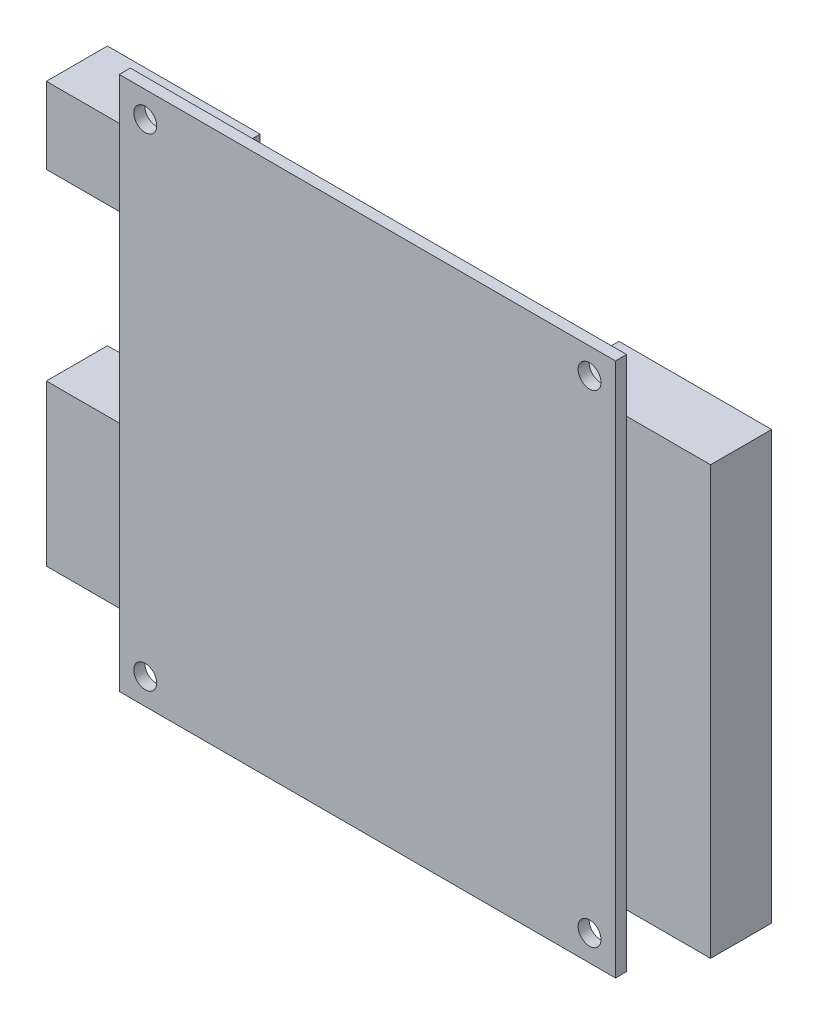
ISO-10303-21;
HEADER;
FILE_DESCRIPTION(('STEP AP214'),'2;1');
FILE_NAME('part.step','',(''),(''),'','','');
FILE_SCHEMA(('AUTOMOTIVE_DESIGN { 1 0 10303 214 1 1 1 1 }'));
ENDSEC;
DATA;
#1=APPLICATION_CONTEXT('core data for automotive mechanical design processes');
#2=APPLICATION_PROTOCOL_DEFINITION('international standard','automotive_design',2000,#1);
#3=PRODUCT_CONTEXT('',#1,'mechanical');
#4=PRODUCT('Part','Part','',(#3));
#5=PRODUCT_RELATED_PRODUCT_CATEGORY('part','',(#4));
#6=PRODUCT_DEFINITION_FORMATION('','',#4);
#7=PRODUCT_DEFINITION_CONTEXT('part definition',#1,'design');
#8=PRODUCT_DEFINITION('design','',#6,#7);
#9=PRODUCT_DEFINITION_SHAPE('','',#8);
#10=(LENGTH_UNIT() NAMED_UNIT(*) SI_UNIT(.MILLI.,.METRE.));
#11=(NAMED_UNIT(*) PLANE_ANGLE_UNIT() SI_UNIT($,.RADIAN.));
#12=(NAMED_UNIT(*) SI_UNIT($,.STERADIAN.) SOLID_ANGLE_UNIT());
#13=UNCERTAINTY_MEASURE_WITH_UNIT(LENGTH_MEASURE(1.E-05),#10,'distance_accuracy_value','');
#14=(GEOMETRIC_REPRESENTATION_CONTEXT(3) GLOBAL_UNCERTAINTY_ASSIGNED_CONTEXT((#13)) GLOBAL_UNIT_ASSIGNED_CONTEXT((#10,
#11,#12)) REPRESENTATION_CONTEXT('',''));
#15=CARTESIAN_POINT('',(0.,0.,0.));
#16=DIRECTION('',(0.,0.,1.));
#17=DIRECTION('',(1.,0.,0.));
#18=AXIS2_PLACEMENT_3D('',#15,#16,#17);
#19=CARTESIAN_POINT('',(0.,0.,0.));
#20=DIRECTION('',(0.,0.,1.));
#21=DIRECTION('',(1.,0.,0.));
#22=AXIS2_PLACEMENT_3D('',#19,#20,#21);
#23=PLANE('',#22);
#24=CARTESIAN_POINT('',(-29.1000000000001,-31.6000000000001,0.));
#25=DIRECTION('',(0.,0.,1.));
#26=DIRECTION('',(-1.,0.,0.));
#27=AXIS2_PLACEMENT_3D('',#24,#25,#26);
#28=CIRCLE('',#27,1.5);
#29=CARTESIAN_POINT('',(-30.6000000000001,-31.6000000000001,0.));
#30=VERTEX_POINT('',#29);
#31=EDGE_CURVE('E339',#30,#30,#28,.T.);
#32=ORIENTED_EDGE('',*,*,#31,.T.);
#33=EDGE_LOOP('',(#32));
#34=FACE_BOUND('',#33,.T.);
#35=CARTESIAN_POINT('',(29.1000000000001,-31.6000000000001,0.));
#36=DIRECTION('',(0.,0.,-1.));
#37=DIRECTION('',(1.,0.,0.));
#38=AXIS2_PLACEMENT_3D('',#35,#36,#37);
#39=CIRCLE('',#38,1.5);
#40=CARTESIAN_POINT('',(30.6000000000001,-31.6000000000001,0.));
#41=VERTEX_POINT('',#40);
#42=EDGE_CURVE('E343',#41,#41,#39,.T.);
#43=ORIENTED_EDGE('',*,*,#42,.F.);
#44=EDGE_LOOP('',(#43));
#45=FACE_BOUND('',#44,.T.);
#46=CARTESIAN_POINT('',(29.1000000000001,31.6000000000001,0.));
#47=DIRECTION('',(0.,0.,1.));
#48=DIRECTION('',(1.,0.,0.));
#49=AXIS2_PLACEMENT_3D('',#46,#47,#48);
#50=CIRCLE('',#49,1.5);
#51=CARTESIAN_POINT('',(30.6000000000001,31.6000000000001,0.));
#52=VERTEX_POINT('',#51);
#53=EDGE_CURVE('E349',#52,#52,#50,.T.);
#54=ORIENTED_EDGE('',*,*,#53,.T.);
#55=EDGE_LOOP('',(#54));
#56=FACE_BOUND('',#55,.T.);
#57=CARTESIAN_POINT('',(-29.1000000000001,31.6000000000001,0.));
#58=DIRECTION('',(0.,0.,-1.));
#59=DIRECTION('',(-1.,0.,0.));
#60=AXIS2_PLACEMENT_3D('',#57,#58,#59);
#61=CIRCLE('',#60,1.5);
#62=CARTESIAN_POINT('',(-30.6000000000001,31.6000000000001,0.));
#63=VERTEX_POINT('',#62);
#64=EDGE_CURVE('E355',#63,#63,#61,.T.);
#65=ORIENTED_EDGE('',*,*,#64,.F.);
#66=EDGE_LOOP('',(#65));
#67=FACE_BOUND('',#66,.T.);
#68=DIRECTION('',(-1.,0.,0.));
#69=VECTOR('',#68,1.);
#70=CARTESIAN_POINT('',(-23.5000000000001,-26.9999999999999,0.));
#71=LINE('',#70,#69);
#72=CARTESIAN_POINT('',(-23.5000000000001,-26.9999999999999,0.));
#73=VERTEX_POINT('',#72);
#74=CARTESIAN_POINT('',(-32.5000000000001,-26.9999999999999,0.));
#75=VERTEX_POINT('',#74);
#76=EDGE_CURVE('E51',#73,#75,#71,.T.);
#77=ORIENTED_EDGE('',*,*,#76,.F.);
#78=DIRECTION('',(0.,-1.,0.));
#79=VECTOR('',#78,1.);
#80=CARTESIAN_POINT('',(-23.5000000000001,-5.99999999999991,0.));
#81=LINE('',#80,#79);
#82=CARTESIAN_POINT('',(-23.5000000000001,-5.99999999999991,0.));
#83=VERTEX_POINT('',#82);
#84=EDGE_CURVE('E252',#83,#73,#81,.T.);
#85=ORIENTED_EDGE('',*,*,#84,.F.);
#86=DIRECTION('',(1.,0.,0.));
#87=VECTOR('',#86,1.);
#88=CARTESIAN_POINT('',(-23.5000000000001,-5.99999999999991,0.));
#89=LINE('',#88,#87);
#90=CARTESIAN_POINT('',(-32.5000000000001,-5.99999999999991,0.));
#91=VERTEX_POINT('',#90);
#92=EDGE_CURVE('E266',#91,#83,#89,.T.);
#93=ORIENTED_EDGE('',*,*,#92,.F.);
#94=DIRECTION('',(0.,-1.,0.));
#95=VECTOR('',#94,1.);
#96=CARTESIAN_POINT('',(-32.5000000000001,35.0000000000001,0.));
#97=LINE('',#96,#95);
#98=CARTESIAN_POINT('',(-32.5000000000001,-4.99999999999991,0.));
#99=VERTEX_POINT('',#98);
#100=EDGE_CURVE('E418',#99,#91,#97,.T.);
#101=ORIENTED_EDGE('',*,*,#100,.F.);
#102=DIRECTION('',(-1.,0.,0.));
#103=VECTOR('',#102,1.);
#104=CARTESIAN_POINT('',(-23.5000000000001,-4.99999999999991,0.));
#105=LINE('',#104,#103);
#106=CARTESIAN_POINT('',(-23.5000000000001,-4.99999999999991,0.));
#107=VERTEX_POINT('',#106);
#108=EDGE_CURVE('E59',#107,#99,#105,.T.);
#109=ORIENTED_EDGE('',*,*,#108,.F.);
#110=DIRECTION('',(0.,-1.,0.));
#111=VECTOR('',#110,1.);
#112=CARTESIAN_POINT('',(-23.5000000000001,17.0000000000001,0.));
#113=LINE('',#112,#111);
#114=CARTESIAN_POINT('',(-23.5000000000001,17.0000000000001,0.));
#115=VERTEX_POINT('',#114);
#116=EDGE_CURVE('E273',#115,#107,#113,.T.);
#117=ORIENTED_EDGE('',*,*,#116,.F.);
#118=DIRECTION('',(1.,0.,0.));
#119=VECTOR('',#118,1.);
#120=CARTESIAN_POINT('',(-23.5000000000001,17.0000000000001,0.));
#121=LINE('',#120,#119);
#122=CARTESIAN_POINT('',(-32.5000000000001,17.0000000000001,0.));
#123=VERTEX_POINT('',#122);
#124=EDGE_CURVE('E291',#123,#115,#121,.T.);
#125=ORIENTED_EDGE('',*,*,#124,.F.);
#126=CARTESIAN_POINT('',(-32.5000000000001,18.0000000000001,0.));
#127=VERTEX_POINT('',#126);
#128=EDGE_CURVE('E414',#127,#123,#97,.T.);
#129=ORIENTED_EDGE('',*,*,#128,.F.);
#130=DIRECTION('',(-1.,0.,0.));
#131=VECTOR('',#130,1.);
#132=CARTESIAN_POINT('',(-23.5000000000001,18.0000000000001,0.));
#133=LINE('',#132,#131);
#134=CARTESIAN_POINT('',(-23.5000000000001,18.0000000000001,0.));
#135=VERTEX_POINT('',#134);
#136=EDGE_CURVE('E317',#135,#127,#133,.T.);
#137=ORIENTED_EDGE('',*,*,#136,.F.);
#138=DIRECTION('',(0.,-1.,0.));
#139=VECTOR('',#138,1.);
#140=CARTESIAN_POINT('',(-23.5000000000001,28.0000000000001,0.));
#141=LINE('',#140,#139);
#142=CARTESIAN_POINT('',(-23.5000000000001,28.0000000000001,0.));
#143=VERTEX_POINT('',#142);
#144=EDGE_CURVE('E304',#143,#135,#141,.T.);
#145=ORIENTED_EDGE('',*,*,#144,.F.);
#146=DIRECTION('',(1.,0.,0.));
#147=VECTOR('',#146,1.);
#148=CARTESIAN_POINT('',(-23.5000000000001,28.0000000000001,0.));
#149=LINE('',#148,#147);
#150=CARTESIAN_POINT('',(-32.5000000000001,28.0000000000001,0.));
#151=VERTEX_POINT('',#150);
#152=EDGE_CURVE('E319',#151,#143,#149,.T.);
#153=ORIENTED_EDGE('',*,*,#152,.F.);
#154=CARTESIAN_POINT('',(-32.5000000000001,35.0000000000001,0.));
#155=VERTEX_POINT('',#154);
#156=EDGE_CURVE('E382',#155,#151,#97,.T.);
#157=ORIENTED_EDGE('',*,*,#156,.F.);
#158=DIRECTION('',(-1.,0.,0.));
#159=VECTOR('',#158,1.);
#160=CARTESIAN_POINT('',(-32.5000000000001,35.0000000000001,0.));
#161=LINE('',#160,#159);
#162=CARTESIAN_POINT('',(32.4999999999999,35.0000000000001,0.));
#163=VERTEX_POINT('',#162);
#164=EDGE_CURVE('E378',#163,#155,#161,.T.);
#165=ORIENTED_EDGE('',*,*,#164,.F.);
#166=DIRECTION('',(0.,1.,0.));
#167=VECTOR('',#166,1.);
#168=CARTESIAN_POINT('',(32.4999999999999,35.0000000000001,0.));
#169=LINE('',#168,#167);
#170=CARTESIAN_POINT('',(32.4999999999999,28.0000000000001,0.));
#171=VERTEX_POINT('',#170);
#172=EDGE_CURVE('E361',#171,#163,#169,.T.);
#173=ORIENTED_EDGE('',*,*,#172,.F.);
#174=DIRECTION('',(1.,0.,0.));
#175=VECTOR('',#174,1.);
#176=CARTESIAN_POINT('',(33.4999999999999,28.0000000000001,0.));
#177=LINE('',#176,#175);
#178=CARTESIAN_POINT('',(23.4999999999999,28.0000000000001,0.));
#179=VERTEX_POINT('',#178);
#180=EDGE_CURVE('E328',#179,#171,#177,.T.);
#181=ORIENTED_EDGE('',*,*,#180,.F.);
#182=DIRECTION('',(0.,1.,0.));
#183=VECTOR('',#182,1.);
#184=CARTESIAN_POINT('',(23.4999999999999,28.0000000000001,0.));
#185=LINE('',#184,#183);
#186=CARTESIAN_POINT('',(23.4999999999999,-27.9999999999999,0.));
#187=VERTEX_POINT('',#186);
#188=EDGE_CURVE('E331',#187,#179,#185,.T.);
#189=ORIENTED_EDGE('',*,*,#188,.F.);
#190=DIRECTION('',(-1.,0.,0.));
#191=VECTOR('',#190,1.);
#192=CARTESIAN_POINT('',(33.4999999999999,-27.9999999999999,0.));
#193=LINE('',#192,#191);
#194=CARTESIAN_POINT('',(32.4999999999999,-27.9999999999999,0.));
#195=VERTEX_POINT('',#194);
#196=EDGE_CURVE('E11',#195,#187,#193,.T.);
#197=ORIENTED_EDGE('',*,*,#196,.F.);
#198=CARTESIAN_POINT('',(32.4999999999999,-34.9999999999999,0.));
#199=VERTEX_POINT('',#198);
#200=EDGE_CURVE('E375',#199,#195,#169,.T.);
#201=ORIENTED_EDGE('',*,*,#200,.F.);
#202=DIRECTION('',(1.,0.,0.));
#203=VECTOR('',#202,1.);
#204=CARTESIAN_POINT('',(-32.5000000000001,-34.9999999999999,0.));
#205=LINE('',#204,#203);
#206=CARTESIAN_POINT('',(-32.5000000000001,-34.9999999999999,0.));
#207=VERTEX_POINT('',#206);
#208=EDGE_CURVE('E368',#207,#199,#205,.T.);
#209=ORIENTED_EDGE('',*,*,#208,.F.);
#210=EDGE_CURVE('E381',#75,#207,#97,.T.);
#211=ORIENTED_EDGE('',*,*,#210,.F.);
#212=EDGE_LOOP('',(#77,#85,#93,#101,#109,#117,#125,#129,#137,#145,#153,#157,#165,#173,#181,#189,
#197,#201,#209,#211));
#213=FACE_BOUND('',#212,.T.);
#214=ADVANCED_FACE('F34',(#34,#45,#56,#67,#213),#23,.F.);
#215=CARTESIAN_POINT('',(32.4999999999999,35.0000000000001,1.45));
#216=DIRECTION('',(-1.,0.,0.));
#217=DIRECTION('',(0.,0.,1.));
#218=AXIS2_PLACEMENT_3D('',#215,#216,#217);
#219=PLANE('',#218);
#220=ORIENTED_EDGE('',*,*,#200,.T.);
#221=EDGE_CURVE('E379',#195,#171,#169,.T.);
#222=ORIENTED_EDGE('',*,*,#221,.T.);
#223=ORIENTED_EDGE('',*,*,#172,.T.);
#224=DIRECTION('',(0.,0.,-1.));
#225=VECTOR('',#224,1.);
#226=CARTESIAN_POINT('',(32.4999999999999,35.0000000000001,1.45));
#227=LINE('',#226,#225);
#228=CARTESIAN_POINT('',(32.4999999999999,35.0000000000001,1.45));
#229=VERTEX_POINT('',#228);
#230=EDGE_CURVE('E38',#229,#163,#227,.T.);
#231=ORIENTED_EDGE('',*,*,#230,.F.);
#232=DIRECTION('',(0.,1.,0.));
#233=VECTOR('',#232,1.);
#234=CARTESIAN_POINT('',(32.4999999999999,35.0000000000001,1.45));
#235=LINE('',#234,#233);
#236=CARTESIAN_POINT('',(32.4999999999999,-34.9999999999999,1.45));
#237=VERTEX_POINT('',#236);
#238=EDGE_CURVE('E364',#237,#229,#235,.T.);
#239=ORIENTED_EDGE('',*,*,#238,.F.);
#240=DIRECTION('',(0.,0.,-1.));
#241=VECTOR('',#240,1.);
#242=CARTESIAN_POINT('',(32.4999999999999,-34.9999999999999,1.45));
#243=LINE('',#242,#241);
#244=EDGE_CURVE('E374',#237,#199,#243,.T.);
#245=ORIENTED_EDGE('',*,*,#244,.T.);
#246=EDGE_LOOP('',(#220,#222,#223,#231,#239,#245));
#247=FACE_BOUND('',#246,.T.);
#248=ADVANCED_FACE('F36',(#247),#219,.F.);
#249=CARTESIAN_POINT('',(-32.5000000000001,35.0000000000001,1.45));
#250=DIRECTION('',(0.,-1.,0.));
#251=DIRECTION('',(0.,0.,-1.));
#252=AXIS2_PLACEMENT_3D('',#249,#250,#251);
#253=PLANE('',#252);
#254=ORIENTED_EDGE('',*,*,#164,.T.);
#255=DIRECTION('',(0.,0.,-1.));
#256=VECTOR('',#255,1.);
#257=CARTESIAN_POINT('',(-32.5000000000001,35.0000000000001,1.45));
#258=LINE('',#257,#256);
#259=CARTESIAN_POINT('',(-32.5000000000001,35.0000000000001,1.45));
#260=VERTEX_POINT('',#259);
#261=EDGE_CURVE('E391',#260,#155,#258,.T.);
#262=ORIENTED_EDGE('',*,*,#261,.F.);
#263=DIRECTION('',(-1.,0.,0.));
#264=VECTOR('',#263,1.);
#265=CARTESIAN_POINT('',(-32.5000000000001,35.0000000000001,1.45));
#266=LINE('',#265,#264);
#267=EDGE_CURVE('E367',#229,#260,#266,.T.);
#268=ORIENTED_EDGE('',*,*,#267,.F.);
#269=ORIENTED_EDGE('',*,*,#230,.T.);
#270=EDGE_LOOP('',(#254,#262,#268,#269));
#271=FACE_BOUND('',#270,.T.);
#272=ADVANCED_FACE('F400',(#271),#253,.F.);
#273=CARTESIAN_POINT('',(-32.5000000000001,35.0000000000001,1.45));
#274=DIRECTION('',(1.,0.,0.));
#275=DIRECTION('',(0.,1.,0.));
#276=AXIS2_PLACEMENT_3D('',#273,#274,#275);
#277=PLANE('',#276);
#278=ORIENTED_EDGE('',*,*,#156,.T.);
#279=EDGE_CURVE('E385',#151,#127,#97,.T.);
#280=ORIENTED_EDGE('',*,*,#279,.T.);
#281=ORIENTED_EDGE('',*,*,#128,.T.);
#282=EDGE_CURVE('E417',#123,#99,#97,.T.);
#283=ORIENTED_EDGE('',*,*,#282,.T.);
#284=ORIENTED_EDGE('',*,*,#100,.T.);
#285=EDGE_CURVE('E420',#91,#75,#97,.T.);
#286=ORIENTED_EDGE('',*,*,#285,.T.);
#287=ORIENTED_EDGE('',*,*,#210,.T.);
#288=DIRECTION('',(0.,0.,-1.));
#289=VECTOR('',#288,1.);
#290=CARTESIAN_POINT('',(-32.5000000000001,-34.9999999999999,1.45));
#291=LINE('',#290,#289);
#292=CARTESIAN_POINT('',(-32.5000000000001,-34.9999999999999,1.45));
#293=VERTEX_POINT('',#292);
#294=EDGE_CURVE('E389',#293,#207,#291,.T.);
#295=ORIENTED_EDGE('',*,*,#294,.F.);
#296=DIRECTION('',(0.,-1.,0.));
#297=VECTOR('',#296,1.);
#298=CARTESIAN_POINT('',(-32.5000000000001,35.0000000000001,1.45));
#299=LINE('',#298,#297);
#300=EDGE_CURVE('E370',#260,#293,#299,.T.);
#301=ORIENTED_EDGE('',*,*,#300,.F.);
#302=ORIENTED_EDGE('',*,*,#261,.T.);
#303=EDGE_LOOP('',(#278,#280,#281,#283,#284,#286,#287,#295,#301,#302));
#304=FACE_BOUND('',#303,.T.);
#305=ADVANCED_FACE('F410',(#304),#277,.F.);
#306=CARTESIAN_POINT('',(-32.5000000000001,-34.9999999999999,1.45));
#307=DIRECTION('',(0.,1.,0.));
#308=DIRECTION('',(0.,0.,1.));
#309=AXIS2_PLACEMENT_3D('',#306,#307,#308);
#310=PLANE('',#309);
#311=ORIENTED_EDGE('',*,*,#208,.T.);
#312=ORIENTED_EDGE('',*,*,#244,.F.);
#313=DIRECTION('',(1.,0.,0.));
#314=VECTOR('',#313,1.);
#315=CARTESIAN_POINT('',(-32.5000000000001,-34.9999999999999,1.45));
#316=LINE('',#315,#314);
#317=EDGE_CURVE('E372',#293,#237,#316,.T.);
#318=ORIENTED_EDGE('',*,*,#317,.F.);
#319=ORIENTED_EDGE('',*,*,#294,.T.);
#320=EDGE_LOOP('',(#311,#312,#318,#319));
#321=FACE_BOUND('',#320,.T.);
#322=ADVANCED_FACE('F428',(#321),#310,.F.);
#323=CARTESIAN_POINT('',(0.,0.,1.45));
#324=DIRECTION('',(0.,0.,1.));
#325=DIRECTION('',(1.,0.,0.));
#326=AXIS2_PLACEMENT_3D('',#323,#324,#325);
#327=PLANE('',#326);
#328=CARTESIAN_POINT('',(-29.1000000000001,-31.6000000000001,1.45));
#329=DIRECTION('',(0.,0.,1.));
#330=DIRECTION('',(-1.,0.,0.));
#331=AXIS2_PLACEMENT_3D('',#328,#329,#330);
#332=CIRCLE('',#331,1.5);
#333=CARTESIAN_POINT('',(-30.6000000000001,-31.6000000000001,1.45));
#334=VERTEX_POINT('',#333);
#335=EDGE_CURVE('E340',#334,#334,#332,.T.);
#336=ORIENTED_EDGE('',*,*,#335,.F.);
#337=EDGE_LOOP('',(#336));
#338=FACE_BOUND('',#337,.T.);
#339=CARTESIAN_POINT('',(29.1000000000001,-31.6000000000001,1.45));
#340=DIRECTION('',(0.,0.,-1.));
#341=DIRECTION('',(1.,0.,0.));
#342=AXIS2_PLACEMENT_3D('',#339,#340,#341);
#343=CIRCLE('',#342,1.5);
#344=CARTESIAN_POINT('',(30.6000000000001,-31.6000000000001,1.45));
#345=VERTEX_POINT('',#344);
#346=EDGE_CURVE('E346',#345,#345,#343,.T.);
#347=ORIENTED_EDGE('',*,*,#346,.T.);
#348=EDGE_LOOP('',(#347));
#349=FACE_BOUND('',#348,.T.);
#350=CARTESIAN_POINT('',(29.1000000000001,31.6000000000001,1.45));
#351=DIRECTION('',(0.,0.,1.));
#352=DIRECTION('',(1.,0.,0.));
#353=AXIS2_PLACEMENT_3D('',#350,#351,#352);
#354=CIRCLE('',#353,1.5);
#355=CARTESIAN_POINT('',(30.6000000000001,31.6000000000001,1.45));
#356=VERTEX_POINT('',#355);
#357=EDGE_CURVE('E352',#356,#356,#354,.T.);
#358=ORIENTED_EDGE('',*,*,#357,.F.);
#359=EDGE_LOOP('',(#358));
#360=FACE_BOUND('',#359,.T.);
#361=CARTESIAN_POINT('',(-29.1000000000001,31.6000000000001,1.45));
#362=DIRECTION('',(0.,0.,-1.));
#363=DIRECTION('',(-1.,0.,0.));
#364=AXIS2_PLACEMENT_3D('',#361,#362,#363);
#365=CIRCLE('',#364,1.5);
#366=CARTESIAN_POINT('',(-30.6000000000001,31.6000000000001,1.45));
#367=VERTEX_POINT('',#366);
#368=EDGE_CURVE('E358',#367,#367,#365,.T.);
#369=ORIENTED_EDGE('',*,*,#368,.T.);
#370=EDGE_LOOP('',(#369));
#371=FACE_BOUND('',#370,.T.);
#372=ORIENTED_EDGE('',*,*,#238,.T.);
#373=ORIENTED_EDGE('',*,*,#267,.T.);
#374=ORIENTED_EDGE('',*,*,#300,.T.);
#375=ORIENTED_EDGE('',*,*,#317,.T.);
#376=EDGE_LOOP('',(#372,#373,#374,#375));
#377=FACE_BOUND('',#376,.T.);
#378=ADVANCED_FACE('F456',(#338,#349,#360,#371,#377),#327,.T.);
#379=CARTESIAN_POINT('',(-29.1000000000001,31.6000000000001,1.45));
#380=DIRECTION('',(0.,0.,-1.));
#381=DIRECTION('',(-1.,0.,0.));
#382=AXIS2_PLACEMENT_3D('',#379,#380,#381);
#383=CYLINDRICAL_SURFACE('',#382,1.5);
#384=ORIENTED_EDGE('',*,*,#368,.F.);
#385=EDGE_LOOP('',(#384));
#386=FACE_BOUND('',#385,.T.);
#387=ORIENTED_EDGE('',*,*,#64,.T.);
#388=EDGE_LOOP('',(#387));
#389=FACE_BOUND('',#388,.T.);
#390=ADVANCED_FACE('F482',(#386,#389),#383,.F.);
#391=CARTESIAN_POINT('',(29.1000000000001,31.6000000000001,1.45));
#392=DIRECTION('',(0.,0.,-1.));
#393=DIRECTION('',(-1.,0.,0.));
#394=AXIS2_PLACEMENT_3D('',#391,#392,#393);
#395=CYLINDRICAL_SURFACE('',#394,1.5);
#396=ORIENTED_EDGE('',*,*,#357,.T.);
#397=EDGE_LOOP('',(#396));
#398=FACE_BOUND('',#397,.T.);
#399=ORIENTED_EDGE('',*,*,#53,.F.);
#400=EDGE_LOOP('',(#399));
#401=FACE_BOUND('',#400,.T.);
#402=ADVANCED_FACE('F490',(#398,#401),#395,.F.);
#403=CARTESIAN_POINT('',(29.1000000000001,-31.6000000000001,1.45));
#404=DIRECTION('',(0.,0.,-1.));
#405=DIRECTION('',(-1.,0.,0.));
#406=AXIS2_PLACEMENT_3D('',#403,#404,#405);
#407=CYLINDRICAL_SURFACE('',#406,1.5);
#408=ORIENTED_EDGE('',*,*,#346,.F.);
#409=EDGE_LOOP('',(#408));
#410=FACE_BOUND('',#409,.T.);
#411=ORIENTED_EDGE('',*,*,#42,.T.);
#412=EDGE_LOOP('',(#411));
#413=FACE_BOUND('',#412,.T.);
#414=ADVANCED_FACE('F496',(#410,#413),#407,.F.);
#415=CARTESIAN_POINT('',(-29.1000000000001,-31.6000000000001,1.45));
#416=DIRECTION('',(0.,0.,-1.));
#417=DIRECTION('',(-1.,0.,0.));
#418=AXIS2_PLACEMENT_3D('',#415,#416,#417);
#419=CYLINDRICAL_SURFACE('',#418,1.5);
#420=ORIENTED_EDGE('',*,*,#335,.T.);
#421=EDGE_LOOP('',(#420));
#422=FACE_BOUND('',#421,.T.);
#423=ORIENTED_EDGE('',*,*,#31,.F.);
#424=EDGE_LOOP('',(#423));
#425=FACE_BOUND('',#424,.T.);
#426=ADVANCED_FACE('F445',(#422,#425),#419,.F.);
#427=CARTESIAN_POINT('',(33.4999999999999,-27.9999999999999,-8.));
#428=DIRECTION('',(0.,1.,0.));
#429=DIRECTION('',(0.,0.,1.));
#430=AXIS2_PLACEMENT_3D('',#427,#428,#429);
#431=PLANE('',#430);
#432=CARTESIAN_POINT('',(43.4999999999999,-27.9999999999999,0.));
#433=VERTEX_POINT('',#432);
#434=EDGE_CURVE('E44',#433,#195,#193,.T.);
#435=ORIENTED_EDGE('',*,*,#434,.T.);
#436=ORIENTED_EDGE('',*,*,#196,.T.);
#437=DIRECTION('',(0.,0.,1.));
#438=VECTOR('',#437,1.);
#439=CARTESIAN_POINT('',(23.4999999999999,-27.9999999999999,-8.));
#440=LINE('',#439,#438);
#441=CARTESIAN_POINT('',(23.4999999999999,-27.9999999999999,-8.));
#442=VERTEX_POINT('',#441);
#443=EDGE_CURVE('E336',#442,#187,#440,.T.);
#444=ORIENTED_EDGE('',*,*,#443,.F.);
#445=DIRECTION('',(-1.,0.,0.));
#446=VECTOR('',#445,1.);
#447=CARTESIAN_POINT('',(33.4999999999999,-27.9999999999999,-8.));
#448=LINE('',#447,#446);
#449=CARTESIAN_POINT('',(43.4999999999999,-27.9999999999999,-8.));
#450=VERTEX_POINT('',#449);
#451=EDGE_CURVE('E326',#450,#442,#448,.T.);
#452=ORIENTED_EDGE('',*,*,#451,.F.);
#453=DIRECTION('',(0.,0.,-1.));
#454=VECTOR('',#453,1.);
#455=CARTESIAN_POINT('',(43.4999999999999,-27.9999999999999,-8.));
#456=LINE('',#455,#454);
#457=EDGE_CURVE('E223',#433,#450,#456,.T.);
#458=ORIENTED_EDGE('',*,*,#457,.F.);
#459=EDGE_LOOP('',(#435,#436,#444,#452,#458));
#460=FACE_BOUND('',#459,.T.);
#461=ADVANCED_FACE('F434',(#460),#431,.F.);
#462=CARTESIAN_POINT('',(23.4999999999999,28.0000000000001,-8.));
#463=DIRECTION('',(1.,0.,0.));
#464=DIRECTION('',(0.,1.,0.));
#465=AXIS2_PLACEMENT_3D('',#462,#463,#464);
#466=PLANE('',#465);
#467=ORIENTED_EDGE('',*,*,#188,.T.);
#468=DIRECTION('',(0.,0.,1.));
#469=VECTOR('',#468,1.);
#470=CARTESIAN_POINT('',(23.4999999999999,28.0000000000001,-8.));
#471=LINE('',#470,#469);
#472=CARTESIAN_POINT('',(23.4999999999999,28.0000000000001,-8.));
#473=VERTEX_POINT('',#472);
#474=EDGE_CURVE('E207',#473,#179,#471,.T.);
#475=ORIENTED_EDGE('',*,*,#474,.F.);
#476=DIRECTION('',(0.,1.,0.));
#477=VECTOR('',#476,1.);
#478=CARTESIAN_POINT('',(23.4999999999999,28.0000000000001,-8.));
#479=LINE('',#478,#477);
#480=EDGE_CURVE('E203',#442,#473,#479,.T.);
#481=ORIENTED_EDGE('',*,*,#480,.F.);
#482=ORIENTED_EDGE('',*,*,#443,.T.);
#483=EDGE_LOOP('',(#467,#475,#481,#482));
#484=FACE_BOUND('',#483,.T.);
#485=ADVANCED_FACE('F437',(#484),#466,.F.);
#486=CARTESIAN_POINT('',(33.4999999999999,28.0000000000001,-8.));
#487=DIRECTION('',(0.,-1.,0.));
#488=DIRECTION('',(0.,0.,-1.));
#489=AXIS2_PLACEMENT_3D('',#486,#487,#488);
#490=PLANE('',#489);
#491=ORIENTED_EDGE('',*,*,#180,.T.);
#492=CARTESIAN_POINT('',(43.4999999999999,28.0000000000001,0.));
#493=VERTEX_POINT('',#492);
#494=EDGE_CURVE('E214',#171,#493,#177,.T.);
#495=ORIENTED_EDGE('',*,*,#494,.T.);
#496=DIRECTION('',(0.,0.,1.));
#497=VECTOR('',#496,1.);
#498=CARTESIAN_POINT('',(43.4999999999999,28.0000000000001,-8.));
#499=LINE('',#498,#497);
#500=CARTESIAN_POINT('',(43.4999999999999,28.0000000000001,-8.));
#501=VERTEX_POINT('',#500);
#502=EDGE_CURVE('E210',#501,#493,#499,.T.);
#503=ORIENTED_EDGE('',*,*,#502,.F.);
#504=DIRECTION('',(1.,0.,0.));
#505=VECTOR('',#504,1.);
#506=CARTESIAN_POINT('',(33.4999999999999,28.0000000000001,-8.));
#507=LINE('',#506,#505);
#508=EDGE_CURVE('E197',#473,#501,#507,.T.);
#509=ORIENTED_EDGE('',*,*,#508,.F.);
#510=ORIENTED_EDGE('',*,*,#474,.T.);
#511=EDGE_LOOP('',(#491,#495,#503,#509,#510));
#512=FACE_BOUND('',#511,.T.);
#513=ADVANCED_FACE('F212',(#512),#490,.F.);
#514=CARTESIAN_POINT('',(0.,0.,-8.));
#515=DIRECTION('',(0.,0.,-1.));
#516=DIRECTION('',(-1.,0.,0.));
#517=AXIS2_PLACEMENT_3D('',#514,#515,#516);
#518=PLANE('',#517);
#519=ORIENTED_EDGE('',*,*,#508,.T.);
#520=DIRECTION('',(0.,1.,0.));
#521=VECTOR('',#520,1.);
#522=CARTESIAN_POINT('',(43.4999999999999,28.0000000000001,-8.));
#523=LINE('',#522,#521);
#524=EDGE_CURVE('E201',#450,#501,#523,.T.);
#525=ORIENTED_EDGE('',*,*,#524,.F.);
#526=ORIENTED_EDGE('',*,*,#451,.T.);
#527=ORIENTED_EDGE('',*,*,#480,.T.);
#528=EDGE_LOOP('',(#519,#525,#526,#527));
#529=FACE_BOUND('',#528,.T.);
#530=ADVANCED_FACE('F199',(#529),#518,.T.);
#531=CARTESIAN_POINT('',(0.,0.,0.));
#532=DIRECTION('',(0.,0.,-1.));
#533=DIRECTION('',(-1.,0.,0.));
#534=AXIS2_PLACEMENT_3D('',#531,#532,#533);
#535=PLANE('',#534);
#536=ORIENTED_EDGE('',*,*,#221,.F.);
#537=ORIENTED_EDGE('',*,*,#434,.F.);
#538=DIRECTION('',(0.,-1.,0.));
#539=VECTOR('',#538,1.);
#540=CARTESIAN_POINT('',(43.4999999999999,28.0000000000001,0.));
#541=LINE('',#540,#539);
#542=EDGE_CURVE('E218',#493,#433,#541,.T.);
#543=ORIENTED_EDGE('',*,*,#542,.F.);
#544=ORIENTED_EDGE('',*,*,#494,.F.);
#545=EDGE_LOOP('',(#536,#537,#543,#544));
#546=FACE_BOUND('',#545,.T.);
#547=ADVANCED_FACE('F432',(#546),#535,.F.);
#548=CARTESIAN_POINT('',(0.,0.,0.));
#549=DIRECTION('',(0.,0.,-1.));
#550=DIRECTION('',(-1.,0.,0.));
#551=AXIS2_PLACEMENT_3D('',#548,#549,#550);
#552=PLANE('',#551);
#553=CARTESIAN_POINT('',(-43.5000000000001,18.0000000000001,0.));
#554=VERTEX_POINT('',#553);
#555=EDGE_CURVE('E316',#127,#554,#133,.T.);
#556=ORIENTED_EDGE('',*,*,#555,.F.);
#557=ORIENTED_EDGE('',*,*,#279,.F.);
#558=CARTESIAN_POINT('',(-43.5000000000001,28.0000000000001,0.));
#559=VERTEX_POINT('',#558);
#560=EDGE_CURVE('E309',#559,#151,#149,.T.);
#561=ORIENTED_EDGE('',*,*,#560,.F.);
#562=DIRECTION('',(0.,1.,0.));
#563=VECTOR('',#562,1.);
#564=CARTESIAN_POINT('',(-43.5000000000001,18.0000000000001,0.));
#565=LINE('',#564,#563);
#566=EDGE_CURVE('E234',#554,#559,#565,.T.);
#567=ORIENTED_EDGE('',*,*,#566,.F.);
#568=EDGE_LOOP('',(#556,#557,#561,#567));
#569=FACE_BOUND('',#568,.T.);
#570=ADVANCED_FACE('F547',(#569),#552,.F.);
#571=CARTESIAN_POINT('',(-23.5000000000001,28.0000000000001,-8.));
#572=DIRECTION('',(-1.,0.,0.));
#573=DIRECTION('',(0.,0.,1.));
#574=AXIS2_PLACEMENT_3D('',#571,#572,#573);
#575=PLANE('',#574);
#576=ORIENTED_EDGE('',*,*,#144,.T.);
#577=DIRECTION('',(0.,0.,1.));
#578=VECTOR('',#577,1.);
#579=CARTESIAN_POINT('',(-23.5000000000001,18.0000000000001,-8.));
#580=LINE('',#579,#578);
#581=CARTESIAN_POINT('',(-23.5000000000001,18.0000000000001,-8.));
#582=VERTEX_POINT('',#581);
#583=EDGE_CURVE('E324',#582,#135,#580,.T.);
#584=ORIENTED_EDGE('',*,*,#583,.F.);
#585=DIRECTION('',(0.,-1.,0.));
#586=VECTOR('',#585,1.);
#587=CARTESIAN_POINT('',(-23.5000000000001,28.0000000000001,-8.));
#588=LINE('',#587,#586);
#589=CARTESIAN_POINT('',(-23.5000000000001,28.0000000000001,-8.));
#590=VERTEX_POINT('',#589);
#591=EDGE_CURVE('E305',#590,#582,#588,.T.);
#592=ORIENTED_EDGE('',*,*,#591,.F.);
#593=DIRECTION('',(0.,0.,1.));
#594=VECTOR('',#593,1.);
#595=CARTESIAN_POINT('',(-23.5000000000001,28.0000000000001,-8.));
#596=LINE('',#595,#594);
#597=EDGE_CURVE('E313',#590,#143,#596,.T.);
#598=ORIENTED_EDGE('',*,*,#597,.T.);
#599=EDGE_LOOP('',(#576,#584,#592,#598));
#600=FACE_BOUND('',#599,.T.);
#601=ADVANCED_FACE('F685',(#600),#575,.F.);
#602=CARTESIAN_POINT('',(-23.5000000000001,18.0000000000001,-8.));
#603=DIRECTION('',(0.,1.,0.));
#604=DIRECTION('',(0.,0.,1.));
#605=AXIS2_PLACEMENT_3D('',#602,#603,#604);
#606=PLANE('',#605);
#607=ORIENTED_EDGE('',*,*,#136,.T.);
#608=ORIENTED_EDGE('',*,*,#555,.T.);
#609=DIRECTION('',(0.,0.,1.));
#610=VECTOR('',#609,1.);
#611=CARTESIAN_POINT('',(-43.5000000000001,18.0000000000001,-8.));
#612=LINE('',#611,#610);
#613=CARTESIAN_POINT('',(-43.5000000000001,18.0000000000001,-8.));
#614=VERTEX_POINT('',#613);
#615=EDGE_CURVE('E231',#614,#554,#612,.T.);
#616=ORIENTED_EDGE('',*,*,#615,.F.);
#617=DIRECTION('',(-1.,0.,0.));
#618=VECTOR('',#617,1.);
#619=CARTESIAN_POINT('',(-23.5000000000001,18.0000000000001,-8.));
#620=LINE('',#619,#618);
#621=EDGE_CURVE('E308',#582,#614,#620,.T.);
#622=ORIENTED_EDGE('',*,*,#621,.F.);
#623=ORIENTED_EDGE('',*,*,#583,.T.);
#624=EDGE_LOOP('',(#607,#608,#616,#622,#623));
#625=FACE_BOUND('',#624,.T.);
#626=ADVANCED_FACE('F677',(#625),#606,.F.);
#627=CARTESIAN_POINT('',(-23.5000000000001,28.0000000000001,-8.));
#628=DIRECTION('',(0.,-1.,0.));
#629=DIRECTION('',(0.,0.,-1.));
#630=AXIS2_PLACEMENT_3D('',#627,#628,#629);
#631=PLANE('',#630);
#632=ORIENTED_EDGE('',*,*,#560,.T.);
#633=ORIENTED_EDGE('',*,*,#152,.T.);
#634=ORIENTED_EDGE('',*,*,#597,.F.);
#635=DIRECTION('',(1.,0.,0.));
#636=VECTOR('',#635,1.);
#637=CARTESIAN_POINT('',(-23.5000000000001,28.0000000000001,-8.));
#638=LINE('',#637,#636);
#639=CARTESIAN_POINT('',(-43.5000000000001,28.0000000000001,-8.));
#640=VERTEX_POINT('',#639);
#641=EDGE_CURVE('E311',#640,#590,#638,.T.);
#642=ORIENTED_EDGE('',*,*,#641,.F.);
#643=DIRECTION('',(0.,0.,-1.));
#644=VECTOR('',#643,1.);
#645=CARTESIAN_POINT('',(-43.5000000000001,28.0000000000001,-8.));
#646=LINE('',#645,#644);
#647=EDGE_CURVE('E237',#559,#640,#646,.T.);
#648=ORIENTED_EDGE('',*,*,#647,.F.);
#649=EDGE_LOOP('',(#632,#633,#634,#642,#648));
#650=FACE_BOUND('',#649,.T.);
#651=ADVANCED_FACE('F669',(#650),#631,.F.);
#652=CARTESIAN_POINT('',(0.,0.,-8.));
#653=DIRECTION('',(0.,0.,-1.));
#654=DIRECTION('',(-1.,0.,0.));
#655=AXIS2_PLACEMENT_3D('',#652,#653,#654);
#656=PLANE('',#655);
#657=ORIENTED_EDGE('',*,*,#591,.T.);
#658=ORIENTED_EDGE('',*,*,#621,.T.);
#659=DIRECTION('',(0.,-1.,0.));
#660=VECTOR('',#659,1.);
#661=CARTESIAN_POINT('',(-43.5000000000001,18.0000000000001,-8.));
#662=LINE('',#661,#660);
#663=EDGE_CURVE('E228',#640,#614,#662,.T.);
#664=ORIENTED_EDGE('',*,*,#663,.F.);
#665=ORIENTED_EDGE('',*,*,#641,.T.);
#666=EDGE_LOOP('',(#657,#658,#664,#665));
#667=FACE_BOUND('',#666,.T.);
#668=ADVANCED_FACE('F661',(#667),#656,.T.);
#669=CARTESIAN_POINT('',(0.,0.,0.));
#670=DIRECTION('',(0.,0.,-1.));
#671=DIRECTION('',(-1.,0.,0.));
#672=AXIS2_PLACEMENT_3D('',#669,#670,#671);
#673=PLANE('',#672);
#674=CARTESIAN_POINT('',(-33.5000000000001,-4.99999999999991,0.));
#675=VERTEX_POINT('',#674);
#676=EDGE_CURVE('E287',#99,#675,#105,.T.);
#677=ORIENTED_EDGE('',*,*,#676,.F.);
#678=ORIENTED_EDGE('',*,*,#282,.F.);
#679=CARTESIAN_POINT('',(-33.5000000000001,17.0000000000001,0.));
#680=VERTEX_POINT('',#679);
#681=EDGE_CURVE('E278',#680,#123,#121,.T.);
#682=ORIENTED_EDGE('',*,*,#681,.F.);
#683=DIRECTION('',(0.,1.,0.));
#684=VECTOR('',#683,1.);
#685=CARTESIAN_POINT('',(-33.5000000000001,17.0000000000001,0.));
#686=LINE('',#685,#684);
#687=EDGE_CURVE('E289',#675,#680,#686,.T.);
#688=ORIENTED_EDGE('',*,*,#687,.F.);
#689=EDGE_LOOP('',(#677,#678,#682,#688));
#690=FACE_BOUND('',#689,.T.);
#691=ADVANCED_FACE('F653',(#690),#673,.F.);
#692=CARTESIAN_POINT('',(-23.5000000000001,17.0000000000001,-8.));
#693=DIRECTION('',(-1.,0.,0.));
#694=DIRECTION('',(0.,-1.,0.));
#695=AXIS2_PLACEMENT_3D('',#692,#693,#694);
#696=PLANE('',#695);
#697=ORIENTED_EDGE('',*,*,#116,.T.);
#698=DIRECTION('',(0.,0.,1.));
#699=VECTOR('',#698,1.);
#700=CARTESIAN_POINT('',(-23.5000000000001,-4.99999999999991,-8.));
#701=LINE('',#700,#699);
#702=CARTESIAN_POINT('',(-23.5000000000001,-4.99999999999991,-8.));
#703=VERTEX_POINT('',#702);
#704=EDGE_CURVE('E302',#703,#107,#701,.T.);
#705=ORIENTED_EDGE('',*,*,#704,.F.);
#706=DIRECTION('',(0.,-1.,0.));
#707=VECTOR('',#706,1.);
#708=CARTESIAN_POINT('',(-23.5000000000001,17.0000000000001,-8.));
#709=LINE('',#708,#707);
#710=CARTESIAN_POINT('',(-23.5000000000001,17.0000000000001,-8.));
#711=VERTEX_POINT('',#710);
#712=EDGE_CURVE('E274',#711,#703,#709,.T.);
#713=ORIENTED_EDGE('',*,*,#712,.F.);
#714=DIRECTION('',(0.,0.,1.));
#715=VECTOR('',#714,1.);
#716=CARTESIAN_POINT('',(-23.5000000000001,17.0000000000001,-8.));
#717=LINE('',#716,#715);
#718=EDGE_CURVE('E284',#711,#115,#717,.T.);
#719=ORIENTED_EDGE('',*,*,#718,.T.);
#720=EDGE_LOOP('',(#697,#705,#713,#719));
#721=FACE_BOUND('',#720,.T.);
#722=ADVANCED_FACE('F646',(#721),#696,.F.);
#723=CARTESIAN_POINT('',(-23.5000000000001,-4.99999999999991,-8.));
#724=DIRECTION('',(0.,1.,0.));
#725=DIRECTION('',(0.,0.,1.));
#726=AXIS2_PLACEMENT_3D('',#723,#724,#725);
#727=PLANE('',#726);
#728=ORIENTED_EDGE('',*,*,#108,.T.);
#729=ORIENTED_EDGE('',*,*,#676,.T.);
#730=DIRECTION('',(0.,0.,1.));
#731=VECTOR('',#730,1.);
#732=CARTESIAN_POINT('',(-33.5000000000001,-4.99999999999991,-8.));
#733=LINE('',#732,#731);
#734=CARTESIAN_POINT('',(-33.5000000000001,-4.99999999999991,-8.));
#735=VERTEX_POINT('',#734);
#736=EDGE_CURVE('E299',#735,#675,#733,.T.);
#737=ORIENTED_EDGE('',*,*,#736,.F.);
#738=DIRECTION('',(-1.,0.,0.));
#739=VECTOR('',#738,1.);
#740=CARTESIAN_POINT('',(-23.5000000000001,-4.99999999999991,-8.));
#741=LINE('',#740,#739);
#742=EDGE_CURVE('E277',#703,#735,#741,.T.);
#743=ORIENTED_EDGE('',*,*,#742,.F.);
#744=ORIENTED_EDGE('',*,*,#704,.T.);
#745=EDGE_LOOP('',(#728,#729,#737,#743,#744));
#746=FACE_BOUND('',#745,.T.);
#747=ADVANCED_FACE('F638',(#746),#727,.F.);
#748=CARTESIAN_POINT('',(-33.5000000000001,17.0000000000001,-8.));
#749=DIRECTION('',(1.,0.,0.));
#750=DIRECTION('',(0.,0.,-1.));
#751=AXIS2_PLACEMENT_3D('',#748,#749,#750);
#752=PLANE('',#751);
#753=ORIENTED_EDGE('',*,*,#687,.T.);
#754=DIRECTION('',(0.,0.,1.));
#755=VECTOR('',#754,1.);
#756=CARTESIAN_POINT('',(-33.5000000000001,17.0000000000001,-8.));
#757=LINE('',#756,#755);
#758=CARTESIAN_POINT('',(-33.5000000000001,17.0000000000001,-8.));
#759=VERTEX_POINT('',#758);
#760=EDGE_CURVE('E296',#759,#680,#757,.T.);
#761=ORIENTED_EDGE('',*,*,#760,.F.);
#762=DIRECTION('',(0.,1.,0.));
#763=VECTOR('',#762,1.);
#764=CARTESIAN_POINT('',(-33.5000000000001,17.0000000000001,-8.));
#765=LINE('',#764,#763);
#766=EDGE_CURVE('E280',#735,#759,#765,.T.);
#767=ORIENTED_EDGE('',*,*,#766,.F.);
#768=ORIENTED_EDGE('',*,*,#736,.T.);
#769=EDGE_LOOP('',(#753,#761,#767,#768));
#770=FACE_BOUND('',#769,.T.);
#771=ADVANCED_FACE('F630',(#770),#752,.F.);
#772=CARTESIAN_POINT('',(-23.5000000000001,17.0000000000001,-8.));
#773=DIRECTION('',(0.,-1.,0.));
#774=DIRECTION('',(0.,0.,-1.));
#775=AXIS2_PLACEMENT_3D('',#772,#773,#774);
#776=PLANE('',#775);
#777=ORIENTED_EDGE('',*,*,#681,.T.);
#778=ORIENTED_EDGE('',*,*,#124,.T.);
#779=ORIENTED_EDGE('',*,*,#718,.F.);
#780=DIRECTION('',(1.,0.,0.));
#781=VECTOR('',#780,1.);
#782=CARTESIAN_POINT('',(-23.5000000000001,17.0000000000001,-8.));
#783=LINE('',#782,#781);
#784=EDGE_CURVE('E282',#759,#711,#783,.T.);
#785=ORIENTED_EDGE('',*,*,#784,.F.);
#786=ORIENTED_EDGE('',*,*,#760,.T.);
#787=EDGE_LOOP('',(#777,#778,#779,#785,#786));
#788=FACE_BOUND('',#787,.T.);
#789=ADVANCED_FACE('F622',(#788),#776,.F.);
#790=CARTESIAN_POINT('',(0.,0.,-8.));
#791=DIRECTION('',(0.,0.,-1.));
#792=DIRECTION('',(-1.,0.,0.));
#793=AXIS2_PLACEMENT_3D('',#790,#791,#792);
#794=PLANE('',#793);
#795=ORIENTED_EDGE('',*,*,#712,.T.);
#796=ORIENTED_EDGE('',*,*,#742,.T.);
#797=ORIENTED_EDGE('',*,*,#766,.T.);
#798=ORIENTED_EDGE('',*,*,#784,.T.);
#799=EDGE_LOOP('',(#795,#796,#797,#798));
#800=FACE_BOUND('',#799,.T.);
#801=ADVANCED_FACE('F614',(#800),#794,.T.);
#802=CARTESIAN_POINT('',(0.,0.,0.));
#803=DIRECTION('',(0.,0.,-1.));
#804=DIRECTION('',(-1.,0.,0.));
#805=AXIS2_PLACEMENT_3D('',#802,#803,#804);
#806=PLANE('',#805);
#807=CARTESIAN_POINT('',(-43.5000000000001,-26.9999999999999,0.));
#808=VERTEX_POINT('',#807);
#809=EDGE_CURVE('E264',#75,#808,#71,.T.);
#810=ORIENTED_EDGE('',*,*,#809,.F.);
#811=ORIENTED_EDGE('',*,*,#285,.F.);
#812=CARTESIAN_POINT('',(-43.5000000000001,-5.99999999999992,0.));
#813=VERTEX_POINT('',#812);
#814=EDGE_CURVE('E257',#813,#91,#89,.T.);
#815=ORIENTED_EDGE('',*,*,#814,.F.);
#816=DIRECTION('',(0.,1.,0.));
#817=VECTOR('',#816,1.);
#818=CARTESIAN_POINT('',(-43.5000000000001,-26.9999999999999,0.));
#819=LINE('',#818,#817);
#820=EDGE_CURVE('E246',#808,#813,#819,.T.);
#821=ORIENTED_EDGE('',*,*,#820,.F.);
#822=EDGE_LOOP('',(#810,#811,#815,#821));
#823=FACE_BOUND('',#822,.T.);
#824=ADVANCED_FACE('F607',(#823),#806,.F.);
#825=CARTESIAN_POINT('',(-23.5000000000001,-5.99999999999991,-8.));
#826=DIRECTION('',(-1.,0.,0.));
#827=DIRECTION('',(0.,-1.,0.));
#828=AXIS2_PLACEMENT_3D('',#825,#826,#827);
#829=PLANE('',#828);
#830=ORIENTED_EDGE('',*,*,#84,.T.);
#831=DIRECTION('',(0.,0.,1.));
#832=VECTOR('',#831,1.);
#833=CARTESIAN_POINT('',(-23.5000000000001,-26.9999999999999,-8.));
#834=LINE('',#833,#832);
#835=CARTESIAN_POINT('',(-23.5000000000001,-26.9999999999999,-8.));
#836=VERTEX_POINT('',#835);
#837=EDGE_CURVE('E271',#836,#73,#834,.T.);
#838=ORIENTED_EDGE('',*,*,#837,.F.);
#839=DIRECTION('',(0.,-1.,0.));
#840=VECTOR('',#839,1.);
#841=CARTESIAN_POINT('',(-23.5000000000001,-5.99999999999991,-8.));
#842=LINE('',#841,#840);
#843=CARTESIAN_POINT('',(-23.5000000000001,-5.99999999999991,-8.));
#844=VERTEX_POINT('',#843);
#845=EDGE_CURVE('E253',#844,#836,#842,.T.);
#846=ORIENTED_EDGE('',*,*,#845,.F.);
#847=DIRECTION('',(0.,0.,1.));
#848=VECTOR('',#847,1.);
#849=CARTESIAN_POINT('',(-23.5000000000001,-5.99999999999991,-8.));
#850=LINE('',#849,#848);
#851=EDGE_CURVE('E261',#844,#83,#850,.T.);
#852=ORIENTED_EDGE('',*,*,#851,.T.);
#853=EDGE_LOOP('',(#830,#838,#846,#852));
#854=FACE_BOUND('',#853,.T.);
#855=ADVANCED_FACE('F600',(#854),#829,.F.);
#856=CARTESIAN_POINT('',(-23.5000000000001,-26.9999999999999,-8.));
#857=DIRECTION('',(0.,1.,0.));
#858=DIRECTION('',(0.,0.,1.));
#859=AXIS2_PLACEMENT_3D('',#856,#857,#858);
#860=PLANE('',#859);
#861=ORIENTED_EDGE('',*,*,#76,.T.);
#862=ORIENTED_EDGE('',*,*,#809,.T.);
#863=DIRECTION('',(0.,0.,1.));
#864=VECTOR('',#863,1.);
#865=CARTESIAN_POINT('',(-43.5000000000001,-26.9999999999999,-8.));
#866=LINE('',#865,#864);
#867=CARTESIAN_POINT('',(-43.5000000000001,-26.9999999999999,-8.));
#868=VERTEX_POINT('',#867);
#869=EDGE_CURVE('E243',#868,#808,#866,.T.);
#870=ORIENTED_EDGE('',*,*,#869,.F.);
#871=DIRECTION('',(-1.,0.,0.));
#872=VECTOR('',#871,1.);
#873=CARTESIAN_POINT('',(-23.5000000000001,-26.9999999999999,-8.));
#874=LINE('',#873,#872);
#875=EDGE_CURVE('E256',#836,#868,#874,.T.);
#876=ORIENTED_EDGE('',*,*,#875,.F.);
#877=ORIENTED_EDGE('',*,*,#837,.T.);
#878=EDGE_LOOP('',(#861,#862,#870,#876,#877));
#879=FACE_BOUND('',#878,.T.);
#880=ADVANCED_FACE('F592',(#879),#860,.F.);
#881=CARTESIAN_POINT('',(-23.5000000000001,-5.99999999999991,-8.));
#882=DIRECTION('',(0.,-1.,0.));
#883=DIRECTION('',(0.,0.,-1.));
#884=AXIS2_PLACEMENT_3D('',#881,#882,#883);
#885=PLANE('',#884);
#886=ORIENTED_EDGE('',*,*,#814,.T.);
#887=ORIENTED_EDGE('',*,*,#92,.T.);
#888=ORIENTED_EDGE('',*,*,#851,.F.);
#889=DIRECTION('',(1.,0.,0.));
#890=VECTOR('',#889,1.);
#891=CARTESIAN_POINT('',(-23.5000000000001,-5.99999999999991,-8.));
#892=LINE('',#891,#890);
#893=CARTESIAN_POINT('',(-43.5000000000001,-5.99999999999992,-8.));
#894=VERTEX_POINT('',#893);
#895=EDGE_CURVE('E259',#894,#844,#892,.T.);
#896=ORIENTED_EDGE('',*,*,#895,.F.);
#897=DIRECTION('',(0.,0.,-1.));
#898=VECTOR('',#897,1.);
#899=CARTESIAN_POINT('',(-43.5000000000001,-5.99999999999992,-8.));
#900=LINE('',#899,#898);
#901=EDGE_CURVE('E249',#813,#894,#900,.T.);
#902=ORIENTED_EDGE('',*,*,#901,.F.);
#903=EDGE_LOOP('',(#886,#887,#888,#896,#902));
#904=FACE_BOUND('',#903,.T.);
#905=ADVANCED_FACE('F584',(#904),#885,.F.);
#906=CARTESIAN_POINT('',(0.,0.,-8.));
#907=DIRECTION('',(0.,0.,-1.));
#908=DIRECTION('',(-1.,0.,0.));
#909=AXIS2_PLACEMENT_3D('',#906,#907,#908);
#910=PLANE('',#909);
#911=ORIENTED_EDGE('',*,*,#845,.T.);
#912=ORIENTED_EDGE('',*,*,#875,.T.);
#913=DIRECTION('',(0.,-1.,0.));
#914=VECTOR('',#913,1.);
#915=CARTESIAN_POINT('',(-43.5000000000001,-26.9999999999999,-8.));
#916=LINE('',#915,#914);
#917=EDGE_CURVE('E240',#894,#868,#916,.T.);
#918=ORIENTED_EDGE('',*,*,#917,.F.);
#919=ORIENTED_EDGE('',*,*,#895,.T.);
#920=EDGE_LOOP('',(#911,#912,#918,#919));
#921=FACE_BOUND('',#920,.T.);
#922=ADVANCED_FACE('F573',(#921),#910,.T.);
#923=CARTESIAN_POINT('',(-43.5000000000001,0.,0.));
#924=DIRECTION('',(1.,0.,0.));
#925=DIRECTION('',(0.,1.,0.));
#926=AXIS2_PLACEMENT_3D('',#923,#924,#925);
#927=PLANE('',#926);
#928=ORIENTED_EDGE('',*,*,#917,.T.);
#929=ORIENTED_EDGE('',*,*,#869,.T.);
#930=ORIENTED_EDGE('',*,*,#820,.T.);
#931=ORIENTED_EDGE('',*,*,#901,.T.);
#932=EDGE_LOOP('',(#928,#929,#930,#931));
#933=FACE_BOUND('',#932,.T.);
#934=ADVANCED_FACE('F566',(#933),#927,.F.);
#935=CARTESIAN_POINT('',(-43.5000000000001,0.,0.));
#936=DIRECTION('',(1.,0.,0.));
#937=DIRECTION('',(0.,0.,-1.));
#938=AXIS2_PLACEMENT_3D('',#935,#936,#937);
#939=PLANE('',#938);
#940=ORIENTED_EDGE('',*,*,#663,.T.);
#941=ORIENTED_EDGE('',*,*,#615,.T.);
#942=ORIENTED_EDGE('',*,*,#566,.T.);
#943=ORIENTED_EDGE('',*,*,#647,.T.);
#944=EDGE_LOOP('',(#940,#941,#942,#943));
#945=FACE_BOUND('',#944,.T.);
#946=ADVANCED_FACE('F524',(#945),#939,.F.);
#947=CARTESIAN_POINT('',(43.4999999999999,0.,0.));
#948=DIRECTION('',(-1.,0.,0.));
#949=DIRECTION('',(0.,0.,1.));
#950=AXIS2_PLACEMENT_3D('',#947,#948,#949);
#951=PLANE('',#950);
#952=ORIENTED_EDGE('',*,*,#524,.T.);
#953=ORIENTED_EDGE('',*,*,#502,.T.);
#954=ORIENTED_EDGE('',*,*,#542,.T.);
#955=ORIENTED_EDGE('',*,*,#457,.T.);
#956=EDGE_LOOP('',(#952,#953,#954,#955));
#957=FACE_BOUND('',#956,.T.);
#958=ADVANCED_FACE('F221',(#957),#951,.F.);
#959=CLOSED_SHELL('',(#214,#248,#272,#305,#322,#378,#390,#402,#414,#426,#461,#485,#513,#530,
#547,#570,#601,#626,#651,#668,#691,#722,#747,#771,#789,#801,#824,#855,#880,#905,#922,#934,#946,#958));
#960=MANIFOLD_SOLID_BREP('B2',#959);
#961=ADVANCED_BREP_SHAPE_REPRESENTATION('',(#18,#960),#14);
#962=SHAPE_DEFINITION_REPRESENTATION(#9,#961);
ENDSEC;
END-ISO-10303-21;
